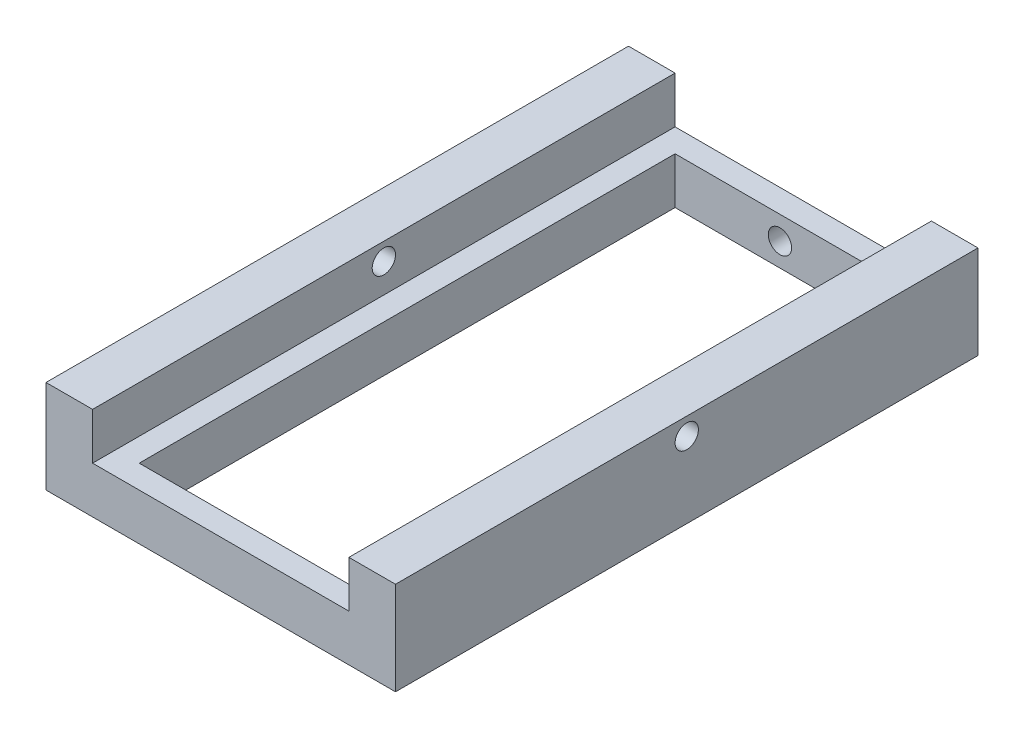
ISO-10303-21;
HEADER;
FILE_DESCRIPTION(('STEP AP214'),'2;1');
FILE_NAME('part.step','',(''),(''),'','','');
FILE_SCHEMA(('AUTOMOTIVE_DESIGN { 1 0 10303 214 1 1 1 1 }'));
ENDSEC;
DATA;
#1=APPLICATION_CONTEXT('core data for automotive mechanical design processes');
#2=APPLICATION_PROTOCOL_DEFINITION('international standard','automotive_design',2000,#1);
#3=PRODUCT_CONTEXT('',#1,'mechanical');
#4=PRODUCT('Part','Part','',(#3));
#5=PRODUCT_RELATED_PRODUCT_CATEGORY('part','',(#4));
#6=PRODUCT_DEFINITION_FORMATION('','',#4);
#7=PRODUCT_DEFINITION_CONTEXT('part definition',#1,'design');
#8=PRODUCT_DEFINITION('design','',#6,#7);
#9=PRODUCT_DEFINITION_SHAPE('','',#8);
#10=(LENGTH_UNIT() NAMED_UNIT(*) SI_UNIT(.MILLI.,.METRE.));
#11=(NAMED_UNIT(*) PLANE_ANGLE_UNIT() SI_UNIT($,.RADIAN.));
#12=(NAMED_UNIT(*) SI_UNIT($,.STERADIAN.) SOLID_ANGLE_UNIT());
#13=UNCERTAINTY_MEASURE_WITH_UNIT(LENGTH_MEASURE(1.E-05),#10,'distance_accuracy_value','');
#14=(GEOMETRIC_REPRESENTATION_CONTEXT(3) GLOBAL_UNCERTAINTY_ASSIGNED_CONTEXT((#13)) GLOBAL_UNIT_ASSIGNED_CONTEXT((#10,
#11,#12)) REPRESENTATION_CONTEXT('',''));
#15=CARTESIAN_POINT('',(0.,0.,0.));
#16=DIRECTION('',(0.,0.,1.));
#17=DIRECTION('',(1.,0.,0.));
#18=AXIS2_PLACEMENT_3D('',#15,#16,#17);
#19=CARTESIAN_POINT('',(-110.,9.99999999999997,250.));
#20=DIRECTION('',(-1.,0.,0.));
#21=DIRECTION('',(0.,0.,1.));
#22=AXIS2_PLACEMENT_3D('',#19,#20,#21);
#23=PLANE('',#22);
#24=CARTESIAN_POINT('',(-110.,35.,0.));
#25=DIRECTION('',(-1.,0.,0.));
#26=DIRECTION('',(0.,0.,1.));
#27=AXIS2_PLACEMENT_3D('',#24,#25,#26);
#28=CIRCLE('',#27,10.);
#29=CARTESIAN_POINT('',(-110.,35.,10.));
#30=VERTEX_POINT('',#29);
#31=EDGE_CURVE('E321',#30,#30,#28,.T.);
#32=ORIENTED_EDGE('',*,*,#31,.T.);
#33=EDGE_LOOP('',(#32));
#34=FACE_BOUND('',#33,.T.);
#35=DIRECTION('',(0.,1.,0.));
#36=VECTOR('',#35,1.);
#37=CARTESIAN_POINT('',(-110.,9.99999999999997,-250.));
#38=LINE('',#37,#36);
#39=CARTESIAN_POINT('',(-110.,9.99999999999997,-250.));
#40=VERTEX_POINT('',#39);
#41=CARTESIAN_POINT('',(-110.,50.,-250.));
#42=VERTEX_POINT('',#41);
#43=EDGE_CURVE('E183',#40,#42,#38,.T.);
#44=ORIENTED_EDGE('',*,*,#43,.T.);
#45=DIRECTION('',(0.,0.,-1.));
#46=VECTOR('',#45,1.);
#47=CARTESIAN_POINT('',(-110.,50.,250.));
#48=LINE('',#47,#46);
#49=CARTESIAN_POINT('',(-110.,50.,250.));
#50=VERTEX_POINT('',#49);
#51=EDGE_CURVE('E11',#50,#42,#48,.T.);
#52=ORIENTED_EDGE('',*,*,#51,.F.);
#53=DIRECTION('',(0.,1.,0.));
#54=VECTOR('',#53,1.);
#55=CARTESIAN_POINT('',(-110.,9.99999999999997,250.));
#56=LINE('',#55,#54);
#57=CARTESIAN_POINT('',(-110.,9.99999999999997,250.));
#58=VERTEX_POINT('',#57);
#59=EDGE_CURVE('E189',#58,#50,#56,.T.);
#60=ORIENTED_EDGE('',*,*,#59,.F.);
#61=DIRECTION('',(0.,0.,-1.));
#62=VECTOR('',#61,1.);
#63=CARTESIAN_POINT('',(-110.,9.99999999999997,250.));
#64=LINE('',#63,#62);
#65=EDGE_CURVE('E219',#58,#40,#64,.T.);
#66=ORIENTED_EDGE('',*,*,#65,.T.);
#67=EDGE_LOOP('',(#44,#52,#60,#66));
#68=FACE_BOUND('',#67,.T.);
#69=ADVANCED_FACE('F47',(#34,#68),#23,.F.);
#70=CARTESIAN_POINT('',(-150.,50.,250.));
#71=DIRECTION('',(0.,1.,0.));
#72=DIRECTION('',(-1.,0.,0.));
#73=AXIS2_PLACEMENT_3D('',#70,#71,#72);
#74=PLANE('',#73);
#75=DIRECTION('',(1.,0.,0.));
#76=VECTOR('',#75,1.);
#77=CARTESIAN_POINT('',(-150.,50.,-250.));
#78=LINE('',#77,#76);
#79=CARTESIAN_POINT('',(-150.,50.,-250.));
#80=VERTEX_POINT('',#79);
#81=EDGE_CURVE('E223',#80,#42,#78,.T.);
#82=ORIENTED_EDGE('',*,*,#81,.F.);
#83=DIRECTION('',(0.,0.,-1.));
#84=VECTOR('',#83,1.);
#85=CARTESIAN_POINT('',(-150.,50.,250.));
#86=LINE('',#85,#84);
#87=CARTESIAN_POINT('',(-150.,50.,250.));
#88=VERTEX_POINT('',#87);
#89=EDGE_CURVE('E56',#88,#80,#86,.T.);
#90=ORIENTED_EDGE('',*,*,#89,.F.);
#91=DIRECTION('',(1.,0.,0.));
#92=VECTOR('',#91,1.);
#93=CARTESIAN_POINT('',(-150.,50.,250.));
#94=LINE('',#93,#92);
#95=EDGE_CURVE('E192',#88,#50,#94,.T.);
#96=ORIENTED_EDGE('',*,*,#95,.T.);
#97=ORIENTED_EDGE('',*,*,#51,.T.);
#98=EDGE_LOOP('',(#82,#90,#96,#97));
#99=FACE_BOUND('',#98,.T.);
#100=ADVANCED_FACE('F276',(#99),#74,.T.);
#101=CARTESIAN_POINT('',(-150.,9.99999999999998,250.));
#102=DIRECTION('',(1.,0.,0.));
#103=DIRECTION('',(0.,0.,-1.));
#104=AXIS2_PLACEMENT_3D('',#101,#102,#103);
#105=PLANE('',#104);
#106=CARTESIAN_POINT('',(-150.,35.,0.));
#107=DIRECTION('',(-1.,0.,0.));
#108=DIRECTION('',(0.,0.,1.));
#109=AXIS2_PLACEMENT_3D('',#106,#107,#108);
#110=CIRCLE('',#109,10.);
#111=CARTESIAN_POINT('',(-150.,35.,10.));
#112=VERTEX_POINT('',#111);
#113=EDGE_CURVE('E386',#112,#112,#110,.T.);
#114=ORIENTED_EDGE('',*,*,#113,.F.);
#115=EDGE_LOOP('',(#114));
#116=FACE_BOUND('',#115,.T.);
#117=DIRECTION('',(0.,-1.,0.));
#118=VECTOR('',#117,1.);
#119=CARTESIAN_POINT('',(-150.,9.99999999999998,-250.));
#120=LINE('',#119,#118);
#121=CARTESIAN_POINT('',(-150.,-30.,-250.));
#122=VERTEX_POINT('',#121);
#123=EDGE_CURVE('E227',#80,#122,#120,.T.);
#124=ORIENTED_EDGE('',*,*,#123,.T.);
#125=DIRECTION('',(0.,0.,-1.));
#126=VECTOR('',#125,1.);
#127=CARTESIAN_POINT('',(-150.,-30.,250.));
#128=LINE('',#127,#126);
#129=CARTESIAN_POINT('',(-150.,-30.,250.));
#130=VERTEX_POINT('',#129);
#131=EDGE_CURVE('E264',#130,#122,#128,.T.);
#132=ORIENTED_EDGE('',*,*,#131,.F.);
#133=DIRECTION('',(0.,1.,0.));
#134=VECTOR('',#133,1.);
#135=CARTESIAN_POINT('',(-150.,9.99999999999998,250.));
#136=LINE('',#135,#134);
#137=EDGE_CURVE('E197',#130,#88,#136,.T.);
#138=ORIENTED_EDGE('',*,*,#137,.T.);
#139=ORIENTED_EDGE('',*,*,#89,.T.);
#140=EDGE_LOOP('',(#124,#132,#138,#139));
#141=FACE_BOUND('',#140,.T.);
#142=ADVANCED_FACE('F272',(#116,#141),#105,.F.);
#143=CARTESIAN_POINT('',(-150.,-30.,250.));
#144=DIRECTION('',(0.,1.,0.));
#145=DIRECTION('',(0.,0.,1.));
#146=AXIS2_PLACEMENT_3D('',#143,#144,#145);
#147=PLANE('',#146);
#148=DIRECTION('',(-1.,0.,0.));
#149=VECTOR('',#148,1.);
#150=CARTESIAN_POINT('',(-90.,-30.0000000000001,-230.));
#151=LINE('',#150,#149);
#152=CARTESIAN_POINT('',(90.,-30.,-230.));
#153=VERTEX_POINT('',#152);
#154=CARTESIAN_POINT('',(-90.,-30.0000000000001,-230.));
#155=VERTEX_POINT('',#154);
#156=EDGE_CURVE('E145',#153,#155,#151,.T.);
#157=ORIENTED_EDGE('',*,*,#156,.T.);
#158=DIRECTION('',(0.,0.,1.));
#159=VECTOR('',#158,1.);
#160=CARTESIAN_POINT('',(-90.,-30.0000000000001,-230.));
#161=LINE('',#160,#159);
#162=CARTESIAN_POINT('',(-90.0000000000001,-30.0000000000001,230.));
#163=VERTEX_POINT('',#162);
#164=EDGE_CURVE('E138',#155,#163,#161,.T.);
#165=ORIENTED_EDGE('',*,*,#164,.T.);
#166=DIRECTION('',(1.,0.,0.));
#167=VECTOR('',#166,1.);
#168=CARTESIAN_POINT('',(-90.0000000000001,-30.0000000000001,230.));
#169=LINE('',#168,#167);
#170=CARTESIAN_POINT('',(90.0000000000001,-30.,230.));
#171=VERTEX_POINT('',#170);
#172=EDGE_CURVE('E148',#163,#171,#169,.T.);
#173=ORIENTED_EDGE('',*,*,#172,.T.);
#174=DIRECTION('',(0.,0.,-1.));
#175=VECTOR('',#174,1.);
#176=CARTESIAN_POINT('',(90.,-30.,-230.));
#177=LINE('',#176,#175);
#178=EDGE_CURVE('E63',#171,#153,#177,.T.);
#179=ORIENTED_EDGE('',*,*,#178,.T.);
#180=EDGE_LOOP('',(#157,#165,#173,#179));
#181=FACE_BOUND('',#180,.T.);
#182=DIRECTION('',(1.,0.,0.));
#183=VECTOR('',#182,1.);
#184=CARTESIAN_POINT('',(-150.,-30.,-250.));
#185=LINE('',#184,#183);
#186=CARTESIAN_POINT('',(150.,-30.,-250.));
#187=VERTEX_POINT('',#186);
#188=EDGE_CURVE('E230',#122,#187,#185,.T.);
#189=ORIENTED_EDGE('',*,*,#188,.T.);
#190=DIRECTION('',(0.,0.,-1.));
#191=VECTOR('',#190,1.);
#192=CARTESIAN_POINT('',(150.,-30.,250.));
#193=LINE('',#192,#191);
#194=CARTESIAN_POINT('',(150.,-30.,250.));
#195=VERTEX_POINT('',#194);
#196=EDGE_CURVE('E260',#195,#187,#193,.T.);
#197=ORIENTED_EDGE('',*,*,#196,.F.);
#198=DIRECTION('',(1.,0.,0.));
#199=VECTOR('',#198,1.);
#200=CARTESIAN_POINT('',(-150.,-30.,250.));
#201=LINE('',#200,#199);
#202=EDGE_CURVE('E201',#130,#195,#201,.T.);
#203=ORIENTED_EDGE('',*,*,#202,.F.);
#204=ORIENTED_EDGE('',*,*,#131,.T.);
#205=EDGE_LOOP('',(#189,#197,#203,#204));
#206=FACE_BOUND('',#205,.T.);
#207=ADVANCED_FACE('F153',(#181,#206),#147,.F.);
#208=CARTESIAN_POINT('',(150.,9.99999999999998,250.));
#209=DIRECTION('',(-1.,0.,0.));
#210=DIRECTION('',(0.,0.,1.));
#211=AXIS2_PLACEMENT_3D('',#208,#209,#210);
#212=PLANE('',#211);
#213=CARTESIAN_POINT('',(150.,35.,0.));
#214=DIRECTION('',(-1.,0.,0.));
#215=DIRECTION('',(0.,0.,1.));
#216=AXIS2_PLACEMENT_3D('',#213,#214,#215);
#217=CIRCLE('',#216,10.);
#218=CARTESIAN_POINT('',(150.,35.,10.));
#219=VERTEX_POINT('',#218);
#220=EDGE_CURVE('E332',#219,#219,#217,.F.);
#221=ORIENTED_EDGE('',*,*,#220,.F.);
#222=EDGE_LOOP('',(#221));
#223=FACE_BOUND('',#222,.T.);
#224=DIRECTION('',(0.,1.,0.));
#225=VECTOR('',#224,1.);
#226=CARTESIAN_POINT('',(150.,9.99999999999998,-250.));
#227=LINE('',#226,#225);
#228=CARTESIAN_POINT('',(150.,50.,-250.));
#229=VERTEX_POINT('',#228);
#230=EDGE_CURVE('E234',#187,#229,#227,.T.);
#231=ORIENTED_EDGE('',*,*,#230,.T.);
#232=DIRECTION('',(0.,0.,-1.));
#233=VECTOR('',#232,1.);
#234=CARTESIAN_POINT('',(150.,50.,250.));
#235=LINE('',#234,#233);
#236=CARTESIAN_POINT('',(150.,50.,250.));
#237=VERTEX_POINT('',#236);
#238=EDGE_CURVE('E256',#237,#229,#235,.T.);
#239=ORIENTED_EDGE('',*,*,#238,.F.);
#240=DIRECTION('',(0.,-1.,0.));
#241=VECTOR('',#240,1.);
#242=CARTESIAN_POINT('',(150.,9.99999999999998,250.));
#243=LINE('',#242,#241);
#244=EDGE_CURVE('E204',#237,#195,#243,.T.);
#245=ORIENTED_EDGE('',*,*,#244,.T.);
#246=ORIENTED_EDGE('',*,*,#196,.T.);
#247=EDGE_LOOP('',(#231,#239,#245,#246));
#248=FACE_BOUND('',#247,.T.);
#249=ADVANCED_FACE('F303',(#223,#248),#212,.F.);
#250=CARTESIAN_POINT('',(150.,50.,250.));
#251=DIRECTION('',(0.,-1.,0.));
#252=DIRECTION('',(1.,0.,0.));
#253=AXIS2_PLACEMENT_3D('',#250,#251,#252);
#254=PLANE('',#253);
#255=DIRECTION('',(-1.,0.,0.));
#256=VECTOR('',#255,1.);
#257=CARTESIAN_POINT('',(150.,50.,-250.));
#258=LINE('',#257,#256);
#259=CARTESIAN_POINT('',(110.,50.,-250.));
#260=VERTEX_POINT('',#259);
#261=EDGE_CURVE('E237',#229,#260,#258,.T.);
#262=ORIENTED_EDGE('',*,*,#261,.T.);
#263=DIRECTION('',(0.,0.,-1.));
#264=VECTOR('',#263,1.);
#265=CARTESIAN_POINT('',(110.,50.,250.));
#266=LINE('',#265,#264);
#267=CARTESIAN_POINT('',(110.,50.,250.));
#268=VERTEX_POINT('',#267);
#269=EDGE_CURVE('E253',#268,#260,#266,.T.);
#270=ORIENTED_EDGE('',*,*,#269,.F.);
#271=DIRECTION('',(-1.,0.,0.));
#272=VECTOR('',#271,1.);
#273=CARTESIAN_POINT('',(150.,50.,250.));
#274=LINE('',#273,#272);
#275=EDGE_CURVE('E208',#237,#268,#274,.T.);
#276=ORIENTED_EDGE('',*,*,#275,.F.);
#277=ORIENTED_EDGE('',*,*,#238,.T.);
#278=EDGE_LOOP('',(#262,#270,#276,#277));
#279=FACE_BOUND('',#278,.T.);
#280=ADVANCED_FACE('F301',(#279),#254,.F.);
#281=CARTESIAN_POINT('',(110.,10.,250.));
#282=DIRECTION('',(-1.,0.,0.));
#283=DIRECTION('',(0.,0.,1.));
#284=AXIS2_PLACEMENT_3D('',#281,#282,#283);
#285=PLANE('',#284);
#286=CARTESIAN_POINT('',(110.,35.,0.));
#287=DIRECTION('',(-1.,0.,0.));
#288=DIRECTION('',(0.,0.,1.));
#289=AXIS2_PLACEMENT_3D('',#286,#287,#288);
#290=CIRCLE('',#289,10.);
#291=CARTESIAN_POINT('',(110.,35.,10.));
#292=VERTEX_POINT('',#291);
#293=EDGE_CURVE('E50',#292,#292,#290,.T.);
#294=ORIENTED_EDGE('',*,*,#293,.F.);
#295=EDGE_LOOP('',(#294));
#296=FACE_BOUND('',#295,.T.);
#297=DIRECTION('',(0.,1.,0.));
#298=VECTOR('',#297,1.);
#299=CARTESIAN_POINT('',(110.,10.,-250.));
#300=LINE('',#299,#298);
#301=CARTESIAN_POINT('',(110.,10.,-250.));
#302=VERTEX_POINT('',#301);
#303=EDGE_CURVE('E241',#302,#260,#300,.T.);
#304=ORIENTED_EDGE('',*,*,#303,.F.);
#305=DIRECTION('',(0.,0.,-1.));
#306=VECTOR('',#305,1.);
#307=CARTESIAN_POINT('',(110.,10.,250.));
#308=LINE('',#307,#306);
#309=CARTESIAN_POINT('',(110.,10.,250.));
#310=VERTEX_POINT('',#309);
#311=EDGE_CURVE('E250',#310,#302,#308,.T.);
#312=ORIENTED_EDGE('',*,*,#311,.F.);
#313=DIRECTION('',(0.,1.,0.));
#314=VECTOR('',#313,1.);
#315=CARTESIAN_POINT('',(110.,10.,250.));
#316=LINE('',#315,#314);
#317=EDGE_CURVE('E211',#310,#268,#316,.T.);
#318=ORIENTED_EDGE('',*,*,#317,.T.);
#319=ORIENTED_EDGE('',*,*,#269,.T.);
#320=EDGE_LOOP('',(#304,#312,#318,#319));
#321=FACE_BOUND('',#320,.T.);
#322=ADVANCED_FACE('F297',(#296,#321),#285,.T.);
#323=CARTESIAN_POINT('',(-110.,9.99999999999997,250.));
#324=DIRECTION('',(0.,1.,0.));
#325=DIRECTION('',(-1.,0.,0.));
#326=AXIS2_PLACEMENT_3D('',#323,#324,#325);
#327=PLANE('',#326);
#328=DIRECTION('',(0.,0.,1.));
#329=VECTOR('',#328,1.);
#330=CARTESIAN_POINT('',(-90.,9.99999999999997,-230.));
#331=LINE('',#330,#329);
#332=CARTESIAN_POINT('',(-90.,9.99999999999997,-230.));
#333=VERTEX_POINT('',#332);
#334=CARTESIAN_POINT('',(-90.0000000000001,9.99999999999997,230.));
#335=VERTEX_POINT('',#334);
#336=EDGE_CURVE('E71',#333,#335,#331,.T.);
#337=ORIENTED_EDGE('',*,*,#336,.F.);
#338=DIRECTION('',(-1.,0.,0.));
#339=VECTOR('',#338,1.);
#340=CARTESIAN_POINT('',(-90.,9.99999999999997,-230.));
#341=LINE('',#340,#339);
#342=CARTESIAN_POINT('',(90.,10.,-230.));
#343=VERTEX_POINT('',#342);
#344=EDGE_CURVE('E157',#343,#333,#341,.T.);
#345=ORIENTED_EDGE('',*,*,#344,.F.);
#346=DIRECTION('',(0.,0.,-1.));
#347=VECTOR('',#346,1.);
#348=CARTESIAN_POINT('',(90.,10.,-230.));
#349=LINE('',#348,#347);
#350=CARTESIAN_POINT('',(90.0000000000001,10.,230.));
#351=VERTEX_POINT('',#350);
#352=EDGE_CURVE('E161',#351,#343,#349,.T.);
#353=ORIENTED_EDGE('',*,*,#352,.F.);
#354=DIRECTION('',(1.,0.,0.));
#355=VECTOR('',#354,1.);
#356=CARTESIAN_POINT('',(-90.0000000000001,9.99999999999997,230.));
#357=LINE('',#356,#355);
#358=EDGE_CURVE('E173',#335,#351,#357,.T.);
#359=ORIENTED_EDGE('',*,*,#358,.F.);
#360=EDGE_LOOP('',(#337,#345,#353,#359));
#361=FACE_BOUND('',#360,.T.);
#362=DIRECTION('',(1.,0.,0.));
#363=VECTOR('',#362,1.);
#364=CARTESIAN_POINT('',(-110.,9.99999999999997,-250.));
#365=LINE('',#364,#363);
#366=EDGE_CURVE('E193',#40,#302,#365,.T.);
#367=ORIENTED_EDGE('',*,*,#366,.F.);
#368=ORIENTED_EDGE('',*,*,#65,.F.);
#369=DIRECTION('',(1.,0.,0.));
#370=VECTOR('',#369,1.);
#371=CARTESIAN_POINT('',(-110.,9.99999999999997,250.));
#372=LINE('',#371,#370);
#373=EDGE_CURVE('E215',#58,#310,#372,.T.);
#374=ORIENTED_EDGE('',*,*,#373,.T.);
#375=ORIENTED_EDGE('',*,*,#311,.T.);
#376=EDGE_LOOP('',(#367,#368,#374,#375));
#377=FACE_BOUND('',#376,.T.);
#378=ADVANCED_FACE('F294',(#361,#377),#327,.T.);
#379=CARTESIAN_POINT('',(0.,0.,250.));
#380=DIRECTION('',(0.,0.,-1.));
#381=DIRECTION('',(-1.,0.,0.));
#382=AXIS2_PLACEMENT_3D('',#379,#380,#381);
#383=PLANE('',#382);
#384=ORIENTED_EDGE('',*,*,#59,.T.);
#385=ORIENTED_EDGE('',*,*,#95,.F.);
#386=ORIENTED_EDGE('',*,*,#137,.F.);
#387=ORIENTED_EDGE('',*,*,#202,.T.);
#388=ORIENTED_EDGE('',*,*,#244,.F.);
#389=ORIENTED_EDGE('',*,*,#275,.T.);
#390=ORIENTED_EDGE('',*,*,#317,.F.);
#391=ORIENTED_EDGE('',*,*,#373,.F.);
#392=EDGE_LOOP('',(#384,#385,#386,#387,#388,#389,#390,#391));
#393=FACE_BOUND('',#392,.T.);
#394=ADVANCED_FACE('F287',(#393),#383,.F.);
#395=CARTESIAN_POINT('',(0.,0.,-250.));
#396=DIRECTION('',(0.,0.,-1.));
#397=DIRECTION('',(-1.,0.,0.));
#398=AXIS2_PLACEMENT_3D('',#395,#396,#397);
#399=PLANE('',#398);
#400=CARTESIAN_POINT('',(0.,-10.,-250.));
#401=DIRECTION('',(0.,0.,-1.));
#402=DIRECTION('',(-1.,0.,0.));
#403=AXIS2_PLACEMENT_3D('',#400,#401,#402);
#404=CIRCLE('',#403,10.);
#405=CARTESIAN_POINT('',(-10.,-10.,-250.));
#406=VERTEX_POINT('',#405);
#407=EDGE_CURVE('E324',#406,#406,#404,.T.);
#408=ORIENTED_EDGE('',*,*,#407,.F.);
#409=EDGE_LOOP('',(#408));
#410=FACE_BOUND('',#409,.T.);
#411=ORIENTED_EDGE('',*,*,#43,.F.);
#412=ORIENTED_EDGE('',*,*,#366,.T.);
#413=ORIENTED_EDGE('',*,*,#303,.T.);
#414=ORIENTED_EDGE('',*,*,#261,.F.);
#415=ORIENTED_EDGE('',*,*,#230,.F.);
#416=ORIENTED_EDGE('',*,*,#188,.F.);
#417=ORIENTED_EDGE('',*,*,#123,.F.);
#418=ORIENTED_EDGE('',*,*,#81,.T.);
#419=EDGE_LOOP('',(#411,#412,#413,#414,#415,#416,#417,#418));
#420=FACE_BOUND('',#419,.T.);
#421=ADVANCED_FACE('F280',(#410,#420),#399,.T.);
#422=CARTESIAN_POINT('',(-90.,-30.0000000000001,-230.));
#423=DIRECTION('',(-1.,0.,0.));
#424=DIRECTION('',(0.,-1.,0.));
#425=AXIS2_PLACEMENT_3D('',#422,#423,#424);
#426=PLANE('',#425);
#427=ORIENTED_EDGE('',*,*,#336,.T.);
#428=DIRECTION('',(0.,1.,0.));
#429=VECTOR('',#428,1.);
#430=CARTESIAN_POINT('',(-90.0000000000001,-30.0000000000001,230.));
#431=LINE('',#430,#429);
#432=EDGE_CURVE('E134',#163,#335,#431,.T.);
#433=ORIENTED_EDGE('',*,*,#432,.F.);
#434=ORIENTED_EDGE('',*,*,#164,.F.);
#435=DIRECTION('',(0.,1.,0.));
#436=VECTOR('',#435,1.);
#437=CARTESIAN_POINT('',(-90.,-30.0000000000001,-230.));
#438=LINE('',#437,#436);
#439=EDGE_CURVE('E180',#155,#333,#438,.T.);
#440=ORIENTED_EDGE('',*,*,#439,.T.);
#441=EDGE_LOOP('',(#427,#433,#434,#440));
#442=FACE_BOUND('',#441,.T.);
#443=ADVANCED_FACE('F136',(#442),#426,.F.);
#444=CARTESIAN_POINT('',(-90.,-30.0000000000001,-230.));
#445=DIRECTION('',(0.,0.,-1.));
#446=DIRECTION('',(-1.,0.,0.));
#447=AXIS2_PLACEMENT_3D('',#444,#445,#446);
#448=PLANE('',#447);
#449=CARTESIAN_POINT('',(0.,-10.,-230.));
#450=DIRECTION('',(0.,0.,-1.));
#451=DIRECTION('',(-1.,0.,0.));
#452=AXIS2_PLACEMENT_3D('',#449,#450,#451);
#453=CIRCLE('',#452,10.);
#454=CARTESIAN_POINT('',(-10.,-10.,-230.));
#455=VERTEX_POINT('',#454);
#456=EDGE_CURVE('E329',#455,#455,#453,.T.);
#457=ORIENTED_EDGE('',*,*,#456,.T.);
#458=EDGE_LOOP('',(#457));
#459=FACE_BOUND('',#458,.T.);
#460=ORIENTED_EDGE('',*,*,#344,.T.);
#461=ORIENTED_EDGE('',*,*,#439,.F.);
#462=ORIENTED_EDGE('',*,*,#156,.F.);
#463=DIRECTION('',(0.,1.,0.));
#464=VECTOR('',#463,1.);
#465=CARTESIAN_POINT('',(90.,-30.,-230.));
#466=LINE('',#465,#464);
#467=EDGE_CURVE('E184',#153,#343,#466,.T.);
#468=ORIENTED_EDGE('',*,*,#467,.T.);
#469=EDGE_LOOP('',(#460,#461,#462,#468));
#470=FACE_BOUND('',#469,.T.);
#471=ADVANCED_FACE('F358',(#459,#470),#448,.F.);
#472=CARTESIAN_POINT('',(90.,-30.,-230.));
#473=DIRECTION('',(1.,0.,0.));
#474=DIRECTION('',(0.,1.,0.));
#475=AXIS2_PLACEMENT_3D('',#472,#473,#474);
#476=PLANE('',#475);
#477=ORIENTED_EDGE('',*,*,#352,.T.);
#478=ORIENTED_EDGE('',*,*,#467,.F.);
#479=ORIENTED_EDGE('',*,*,#178,.F.);
#480=DIRECTION('',(0.,1.,0.));
#481=VECTOR('',#480,1.);
#482=CARTESIAN_POINT('',(90.0000000000001,-30.,230.));
#483=LINE('',#482,#481);
#484=EDGE_CURVE('E144',#171,#351,#483,.T.);
#485=ORIENTED_EDGE('',*,*,#484,.T.);
#486=EDGE_LOOP('',(#477,#478,#479,#485));
#487=FACE_BOUND('',#486,.T.);
#488=ADVANCED_FACE('F349',(#487),#476,.F.);
#489=CARTESIAN_POINT('',(-90.0000000000001,-30.0000000000001,230.));
#490=DIRECTION('',(0.,0.,1.));
#491=DIRECTION('',(1.,0.,0.));
#492=AXIS2_PLACEMENT_3D('',#489,#490,#491);
#493=PLANE('',#492);
#494=CARTESIAN_POINT('',(0.,-10.,230.));
#495=DIRECTION('',(0.,0.,-1.));
#496=DIRECTION('',(-1.,0.,0.));
#497=AXIS2_PLACEMENT_3D('',#494,#495,#496);
#498=CIRCLE('',#497,10.);
#499=CARTESIAN_POINT('',(-10.,-10.,230.));
#500=VERTEX_POINT('',#499);
#501=EDGE_CURVE('E164',#500,#500,#498,.T.);
#502=ORIENTED_EDGE('',*,*,#501,.F.);
#503=EDGE_LOOP('',(#502));
#504=FACE_BOUND('',#503,.T.);
#505=ORIENTED_EDGE('',*,*,#358,.T.);
#506=ORIENTED_EDGE('',*,*,#484,.F.);
#507=ORIENTED_EDGE('',*,*,#172,.F.);
#508=ORIENTED_EDGE('',*,*,#432,.T.);
#509=EDGE_LOOP('',(#505,#506,#507,#508));
#510=FACE_BOUND('',#509,.T.);
#511=ADVANCED_FACE('F149',(#504,#510),#493,.F.);
#512=CARTESIAN_POINT('',(0.,-10.,245.));
#513=DIRECTION('',(0.,0.,-1.));
#514=DIRECTION('',(-1.,0.,0.));
#515=AXIS2_PLACEMENT_3D('',#512,#513,#514);
#516=CYLINDRICAL_SURFACE('',#515,10.);
#517=CARTESIAN_POINT('',(0.,-10.,245.));
#518=DIRECTION('',(0.,0.,-1.));
#519=DIRECTION('',(-1.,0.,0.));
#520=AXIS2_PLACEMENT_3D('',#517,#518,#519);
#521=CIRCLE('',#520,10.);
#522=CARTESIAN_POINT('',(-10.,-10.,245.));
#523=VERTEX_POINT('',#522);
#524=EDGE_CURVE('E174',#523,#523,#521,.T.);
#525=ORIENTED_EDGE('',*,*,#524,.F.);
#526=EDGE_LOOP('',(#525));
#527=FACE_BOUND('',#526,.T.);
#528=ORIENTED_EDGE('',*,*,#501,.T.);
#529=EDGE_LOOP('',(#528));
#530=FACE_BOUND('',#529,.T.);
#531=ADVANCED_FACE('F346',(#527,#530),#516,.F.);
#532=CARTESIAN_POINT('',(0.,-10.,245.));
#533=DIRECTION('',(0.,0.,-1.));
#534=DIRECTION('',(-1.,0.,0.));
#535=AXIS2_PLACEMENT_3D('',#532,#533,#534);
#536=PLANE('',#535);
#537=ORIENTED_EDGE('',*,*,#524,.T.);
#538=EDGE_LOOP('',(#537));
#539=FACE_BOUND('',#538,.T.);
#540=ADVANCED_FACE('F355',(#539),#536,.T.);
#541=CARTESIAN_POINT('',(0.,-10.,-230.));
#542=DIRECTION('',(0.,0.,-1.));
#543=DIRECTION('',(-1.,0.,0.));
#544=AXIS2_PLACEMENT_3D('',#541,#542,#543);
#545=CYLINDRICAL_SURFACE('',#544,10.);
#546=ORIENTED_EDGE('',*,*,#456,.F.);
#547=EDGE_LOOP('',(#546));
#548=FACE_BOUND('',#547,.T.);
#549=ORIENTED_EDGE('',*,*,#407,.T.);
#550=EDGE_LOOP('',(#549));
#551=FACE_BOUND('',#550,.T.);
#552=ADVANCED_FACE('F382',(#548,#551),#545,.F.);
#553=CARTESIAN_POINT('',(178.284271247462,35.,0.));
#554=DIRECTION('',(-1.,0.,0.));
#555=DIRECTION('',(0.,0.,1.));
#556=AXIS2_PLACEMENT_3D('',#553,#554,#555);
#557=CYLINDRICAL_SURFACE('',#556,10.);
#558=ORIENTED_EDGE('',*,*,#293,.T.);
#559=EDGE_LOOP('',(#558));
#560=FACE_BOUND('',#559,.T.);
#561=ORIENTED_EDGE('',*,*,#220,.T.);
#562=EDGE_LOOP('',(#561));
#563=FACE_BOUND('',#562,.T.);
#564=ADVANCED_FACE('F378',(#560,#563),#557,.F.);
#565=ORIENTED_EDGE('',*,*,#113,.T.);
#566=EDGE_LOOP('',(#565));
#567=FACE_BOUND('',#566,.T.);
#568=ORIENTED_EDGE('',*,*,#31,.F.);
#569=EDGE_LOOP('',(#568));
#570=FACE_BOUND('',#569,.T.);
#571=ADVANCED_FACE('F381',(#567,#570),#557,.F.);
#572=CLOSED_SHELL('',(#69,#100,#142,#207,#249,#280,#322,#378,#394,#421,#443,#471,#488,#511,#531,
#540,#552,#564,#571));
#573=MANIFOLD_SOLID_BREP('B2',#572);
#574=ADVANCED_BREP_SHAPE_REPRESENTATION('',(#18,#573),#14);
#575=SHAPE_DEFINITION_REPRESENTATION(#9,#574);
ENDSEC;
END-ISO-10303-21;
